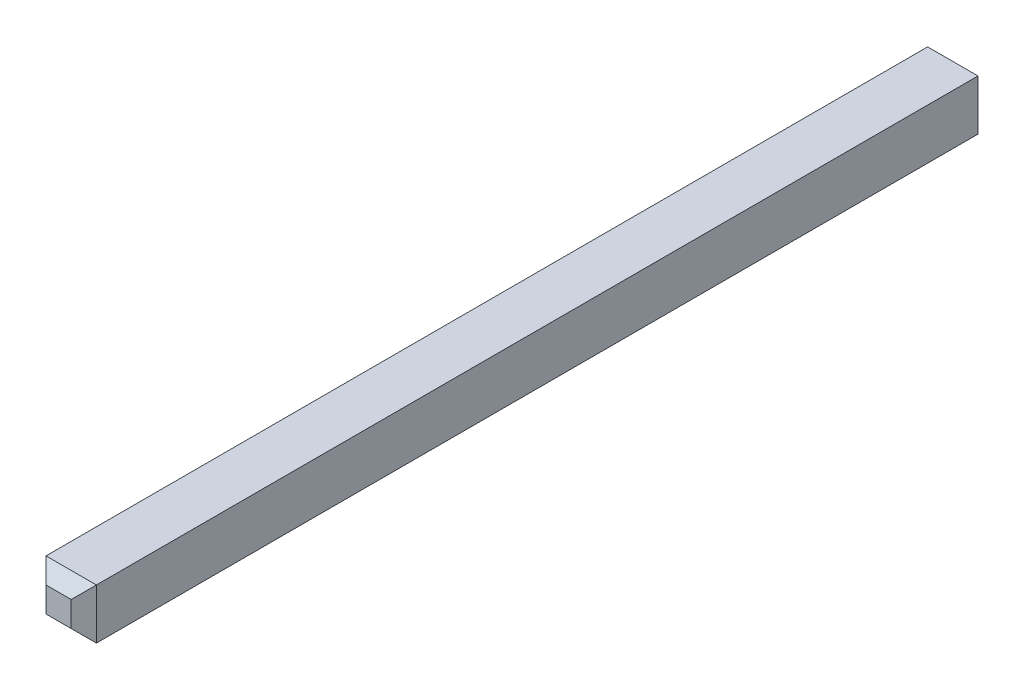
ISO-10303-21;
HEADER;
FILE_DESCRIPTION(('STEP AP214'),'2;1');
FILE_NAME('part.step','',(''),(''),'','','');
FILE_SCHEMA(('AUTOMOTIVE_DESIGN { 1 0 10303 214 1 1 1 1 }'));
ENDSEC;
DATA;
#1=APPLICATION_CONTEXT('core data for automotive mechanical design processes');
#2=APPLICATION_PROTOCOL_DEFINITION('international standard','automotive_design',2000,#1);
#3=PRODUCT_CONTEXT('',#1,'mechanical');
#4=PRODUCT('Part','Part','',(#3));
#5=PRODUCT_RELATED_PRODUCT_CATEGORY('part','',(#4));
#6=PRODUCT_DEFINITION_FORMATION('','',#4);
#7=PRODUCT_DEFINITION_CONTEXT('part definition',#1,'design');
#8=PRODUCT_DEFINITION('design','',#6,#7);
#9=PRODUCT_DEFINITION_SHAPE('','',#8);
#10=(LENGTH_UNIT() NAMED_UNIT(*) SI_UNIT(.MILLI.,.METRE.));
#11=(NAMED_UNIT(*) PLANE_ANGLE_UNIT() SI_UNIT($,.RADIAN.));
#12=(NAMED_UNIT(*) SI_UNIT($,.STERADIAN.) SOLID_ANGLE_UNIT());
#13=UNCERTAINTY_MEASURE_WITH_UNIT(LENGTH_MEASURE(1.E-05),#10,'distance_accuracy_value','');
#14=(GEOMETRIC_REPRESENTATION_CONTEXT(3) GLOBAL_UNCERTAINTY_ASSIGNED_CONTEXT((#13)) GLOBAL_UNIT_ASSIGNED_CONTEXT((#10,
#11,#12)) REPRESENTATION_CONTEXT('',''));
#15=CARTESIAN_POINT('',(0.,0.,0.));
#16=DIRECTION('',(0.,0.,1.));
#17=DIRECTION('',(1.,0.,0.));
#18=AXIS2_PLACEMENT_3D('',#15,#16,#17);
#19=CARTESIAN_POINT('',(-0.15875,-0.238125,-2.460625));
#20=DIRECTION('',(0.,-0.707106781186548,-0.707106781186548));
#21=DIRECTION('',(0.,0.707106781186548,-0.707106781186548));
#22=AXIS2_PLACEMENT_3D('',#19,#20,#21);
#23=PLANE('',#22);
#24=DIRECTION('',(1.,0.,0.));
#25=VECTOR('',#24,1.);
#26=CARTESIAN_POINT('',(-0.3175,-0.3175,-2.38125));
#27=LINE('',#26,#25);
#28=CARTESIAN_POINT('',(-0.3175,-0.3175,-2.38125));
#29=VERTEX_POINT('',#28);
#30=CARTESIAN_POINT('',(0.3175,-0.3175,-2.38125));
#31=VERTEX_POINT('',#30);
#32=EDGE_CURVE('E96',#29,#31,#27,.T.);
#33=ORIENTED_EDGE('',*,*,#32,.F.);
#34=DIRECTION('',(-0.577350269189626,-0.577350269189627,0.577350269189625));
#35=VECTOR('',#34,1.);
#36=CARTESIAN_POINT('',(-0.15875,-0.15875,-2.54));
#37=LINE('',#36,#35);
#38=CARTESIAN_POINT('',(-0.15875,-0.15875,-2.54));
#39=VERTEX_POINT('',#38);
#40=EDGE_CURVE('E94',#39,#29,#37,.T.);
#41=ORIENTED_EDGE('',*,*,#40,.F.);
#42=DIRECTION('',(-1.,0.,0.));
#43=VECTOR('',#42,1.);
#44=CARTESIAN_POINT('',(0.,-0.15875,-2.54));
#45=LINE('',#44,#43);
#46=CARTESIAN_POINT('',(0.15875,-0.15875,-2.54));
#47=VERTEX_POINT('',#46);
#48=EDGE_CURVE('E20',#47,#39,#45,.T.);
#49=ORIENTED_EDGE('',*,*,#48,.F.);
#50=DIRECTION('',(-0.577350269189626,0.577350269189627,-0.577350269189625));
#51=VECTOR('',#50,1.);
#52=CARTESIAN_POINT('',(0.3175,-0.3175,-2.38125));
#53=LINE('',#52,#51);
#54=EDGE_CURVE('E113',#31,#47,#53,.T.);
#55=ORIENTED_EDGE('',*,*,#54,.F.);
#56=EDGE_LOOP('',(#33,#41,#49,#55));
#57=FACE_BOUND('',#56,.T.);
#58=ADVANCED_FACE('F17',(#57),#23,.T.);
#59=CARTESIAN_POINT('',(-0.15875,-0.238125,8.810625));
#60=DIRECTION('',(0.,-0.707106781186547,0.707106781186548));
#61=DIRECTION('',(0.,-0.707106781186548,-0.707106781186547));
#62=AXIS2_PLACEMENT_3D('',#59,#60,#61);
#63=PLANE('',#62);
#64=DIRECTION('',(1.,0.,0.));
#65=VECTOR('',#64,1.);
#66=CARTESIAN_POINT('',(-0.3175,-0.3175,8.73125));
#67=LINE('',#66,#65);
#68=CARTESIAN_POINT('',(0.3175,-0.317500000000001,8.73125));
#69=VERTEX_POINT('',#68);
#70=CARTESIAN_POINT('',(-0.3175,-0.317500000000001,8.73125));
#71=VERTEX_POINT('',#70);
#72=EDGE_CURVE('E121',#69,#71,#67,.F.);
#73=ORIENTED_EDGE('',*,*,#72,.F.);
#74=DIRECTION('',(0.577350269189627,-0.577350269189624,-0.577350269189627));
#75=VECTOR('',#74,1.);
#76=CARTESIAN_POINT('',(0.15875,-0.15875,8.89));
#77=LINE('',#76,#75);
#78=CARTESIAN_POINT('',(0.15875,-0.15875,8.89));
#79=VERTEX_POINT('',#78);
#80=EDGE_CURVE('E118',#79,#69,#77,.T.);
#81=ORIENTED_EDGE('',*,*,#80,.F.);
#82=DIRECTION('',(1.,0.,0.));
#83=VECTOR('',#82,1.);
#84=CARTESIAN_POINT('',(0.,-0.15875,8.89));
#85=LINE('',#84,#83);
#86=CARTESIAN_POINT('',(-0.15875,-0.15875,8.89));
#87=VERTEX_POINT('',#86);
#88=EDGE_CURVE('E79',#87,#79,#85,.T.);
#89=ORIENTED_EDGE('',*,*,#88,.F.);
#90=DIRECTION('',(0.577350269189627,0.577350269189624,0.577350269189627));
#91=VECTOR('',#90,1.);
#92=CARTESIAN_POINT('',(-0.317500000000001,-0.3175,8.73125));
#93=LINE('',#92,#91);
#94=EDGE_CURVE('E106',#71,#87,#93,.T.);
#95=ORIENTED_EDGE('',*,*,#94,.F.);
#96=EDGE_LOOP('',(#73,#81,#89,#95));
#97=FACE_BOUND('',#96,.T.);
#98=ADVANCED_FACE('F283',(#97),#63,.T.);
#99=CARTESIAN_POINT('',(0.,0.,-2.54));
#100=DIRECTION('',(0.,0.,-1.));
#101=DIRECTION('',(-1.,0.,0.));
#102=AXIS2_PLACEMENT_3D('',#99,#100,#101);
#103=PLANE('',#102);
#104=DIRECTION('',(0.,1.,0.));
#105=VECTOR('',#104,1.);
#106=CARTESIAN_POINT('',(0.15875,-0.15875,-2.54));
#107=LINE('',#106,#105);
#108=CARTESIAN_POINT('',(0.15875,0.15875,-2.54));
#109=VERTEX_POINT('',#108);
#110=EDGE_CURVE('E90',#47,#109,#107,.T.);
#111=ORIENTED_EDGE('',*,*,#110,.F.);
#112=ORIENTED_EDGE('',*,*,#48,.T.);
#113=DIRECTION('',(0.,1.,0.));
#114=VECTOR('',#113,1.);
#115=CARTESIAN_POINT('',(-0.15875,0.15875,-2.54));
#116=LINE('',#115,#114);
#117=CARTESIAN_POINT('',(-0.15875,0.15875,-2.54));
#118=VERTEX_POINT('',#117);
#119=EDGE_CURVE('E88',#118,#39,#116,.F.);
#120=ORIENTED_EDGE('',*,*,#119,.F.);
#121=DIRECTION('',(1.,0.,0.));
#122=VECTOR('',#121,1.);
#123=CARTESIAN_POINT('',(0.15875,0.15875,-2.54));
#124=LINE('',#123,#122);
#125=EDGE_CURVE('E127',#109,#118,#124,.F.);
#126=ORIENTED_EDGE('',*,*,#125,.F.);
#127=EDGE_LOOP('',(#111,#112,#120,#126));
#128=FACE_BOUND('',#127,.T.);
#129=ADVANCED_FACE('F85',(#128),#103,.T.);
#130=CARTESIAN_POINT('',(-0.238125,0.15875,-2.460625));
#131=DIRECTION('',(-0.707106781186548,0.,-0.707106781186548));
#132=DIRECTION('',(-0.707106781186548,0.,0.707106781186548));
#133=AXIS2_PLACEMENT_3D('',#130,#131,#132);
#134=PLANE('',#133);
#135=DIRECTION('',(0.,1.,0.));
#136=VECTOR('',#135,1.);
#137=CARTESIAN_POINT('',(-0.3175,0.3175,-2.38125));
#138=LINE('',#137,#136);
#139=CARTESIAN_POINT('',(-0.3175,0.3175,-2.38125));
#140=VERTEX_POINT('',#139);
#141=EDGE_CURVE('E130',#140,#29,#138,.F.);
#142=ORIENTED_EDGE('',*,*,#141,.F.);
#143=DIRECTION('',(-0.577350269189627,0.577350269189626,0.577350269189625));
#144=VECTOR('',#143,1.);
#145=CARTESIAN_POINT('',(-0.15875,0.15875,-2.54));
#146=LINE('',#145,#144);
#147=EDGE_CURVE('E102',#118,#140,#146,.T.);
#148=ORIENTED_EDGE('',*,*,#147,.F.);
#149=ORIENTED_EDGE('',*,*,#119,.T.);
#150=ORIENTED_EDGE('',*,*,#40,.T.);
#151=EDGE_LOOP('',(#142,#148,#149,#150));
#152=FACE_BOUND('',#151,.T.);
#153=ADVANCED_FACE('F100',(#152),#134,.T.);
#154=CARTESIAN_POINT('',(0.,0.,8.89));
#155=DIRECTION('',(0.,0.,1.));
#156=DIRECTION('',(1.,0.,0.));
#157=AXIS2_PLACEMENT_3D('',#154,#155,#156);
#158=PLANE('',#157);
#159=ORIENTED_EDGE('',*,*,#88,.T.);
#160=DIRECTION('',(0.,1.,0.));
#161=VECTOR('',#160,1.);
#162=CARTESIAN_POINT('',(0.15875,-0.15875,8.89));
#163=LINE('',#162,#161);
#164=CARTESIAN_POINT('',(0.15875,0.15875,8.89));
#165=VERTEX_POINT('',#164);
#166=EDGE_CURVE('E115',#165,#79,#163,.F.);
#167=ORIENTED_EDGE('',*,*,#166,.F.);
#168=DIRECTION('',(1.,0.,0.));
#169=VECTOR('',#168,1.);
#170=CARTESIAN_POINT('',(0.15875,0.15875,8.89));
#171=LINE('',#170,#169);
#172=CARTESIAN_POINT('',(-0.15875,0.15875,8.89));
#173=VERTEX_POINT('',#172);
#174=EDGE_CURVE('E139',#173,#165,#171,.T.);
#175=ORIENTED_EDGE('',*,*,#174,.F.);
#176=DIRECTION('',(0.,1.,0.));
#177=VECTOR('',#176,1.);
#178=CARTESIAN_POINT('',(-0.15875,0.15875,8.89));
#179=LINE('',#178,#177);
#180=EDGE_CURVE('E109',#87,#173,#179,.T.);
#181=ORIENTED_EDGE('',*,*,#180,.F.);
#182=EDGE_LOOP('',(#159,#167,#175,#181));
#183=FACE_BOUND('',#182,.T.);
#184=ADVANCED_FACE('F259',(#183),#158,.T.);
#185=CARTESIAN_POINT('',(-0.238125,0.15875,8.810625));
#186=DIRECTION('',(-0.707106781186547,0.,0.707106781186548));
#187=DIRECTION('',(0.707106781186548,0.,0.707106781186547));
#188=AXIS2_PLACEMENT_3D('',#185,#186,#187);
#189=PLANE('',#188);
#190=ORIENTED_EDGE('',*,*,#180,.T.);
#191=DIRECTION('',(0.577350269189624,-0.577350269189627,0.577350269189627));
#192=VECTOR('',#191,1.);
#193=CARTESIAN_POINT('',(-0.3175,0.317500000000001,8.73125));
#194=LINE('',#193,#192);
#195=CARTESIAN_POINT('',(-0.317500000000001,0.3175,8.73125));
#196=VERTEX_POINT('',#195);
#197=EDGE_CURVE('E144',#196,#173,#194,.T.);
#198=ORIENTED_EDGE('',*,*,#197,.F.);
#199=DIRECTION('',(0.,1.,0.));
#200=VECTOR('',#199,1.);
#201=CARTESIAN_POINT('',(-0.3175,0.3175,8.73125));
#202=LINE('',#201,#200);
#203=EDGE_CURVE('E136',#71,#196,#202,.T.);
#204=ORIENTED_EDGE('',*,*,#203,.F.);
#205=ORIENTED_EDGE('',*,*,#94,.T.);
#206=EDGE_LOOP('',(#190,#198,#204,#205));
#207=FACE_BOUND('',#206,.T.);
#208=ADVANCED_FACE('F251',(#207),#189,.T.);
#209=CARTESIAN_POINT('',(0.238125,-0.15875,-2.460625));
#210=DIRECTION('',(0.707106781186548,0.,-0.707106781186548));
#211=DIRECTION('',(-0.707106781186548,0.,-0.707106781186548));
#212=AXIS2_PLACEMENT_3D('',#209,#210,#211);
#213=PLANE('',#212);
#214=DIRECTION('',(0.,1.,0.));
#215=VECTOR('',#214,1.);
#216=CARTESIAN_POINT('',(0.3175,-0.3175,-2.38125));
#217=LINE('',#216,#215);
#218=CARTESIAN_POINT('',(0.3175,0.3175,-2.38125));
#219=VERTEX_POINT('',#218);
#220=EDGE_CURVE('E147',#31,#219,#217,.T.);
#221=ORIENTED_EDGE('',*,*,#220,.F.);
#222=ORIENTED_EDGE('',*,*,#54,.T.);
#223=ORIENTED_EDGE('',*,*,#110,.T.);
#224=DIRECTION('',(-0.577350269189627,-0.577350269189626,-0.577350269189625));
#225=VECTOR('',#224,1.);
#226=CARTESIAN_POINT('',(0.3175,0.3175,-2.38125));
#227=LINE('',#226,#225);
#228=EDGE_CURVE('E124',#219,#109,#227,.T.);
#229=ORIENTED_EDGE('',*,*,#228,.F.);
#230=EDGE_LOOP('',(#221,#222,#223,#229));
#231=FACE_BOUND('',#230,.T.);
#232=ADVANCED_FACE('F173',(#231),#213,.T.);
#233=CARTESIAN_POINT('',(0.238125,-0.15875,8.810625));
#234=DIRECTION('',(0.707106781186547,0.,0.707106781186548));
#235=DIRECTION('',(0.707106781186548,0.,-0.707106781186547));
#236=AXIS2_PLACEMENT_3D('',#233,#234,#235);
#237=PLANE('',#236);
#238=DIRECTION('',(0.,1.,0.));
#239=VECTOR('',#238,1.);
#240=CARTESIAN_POINT('',(0.3175,-0.3175,8.73125));
#241=LINE('',#240,#239);
#242=CARTESIAN_POINT('',(0.317500000000001,0.3175,8.73125));
#243=VERTEX_POINT('',#242);
#244=EDGE_CURVE('E35',#243,#69,#241,.F.);
#245=ORIENTED_EDGE('',*,*,#244,.F.);
#246=DIRECTION('',(0.577350269189624,0.577350269189627,-0.577350269189627));
#247=VECTOR('',#246,1.);
#248=CARTESIAN_POINT('',(0.15875,0.15875,8.89));
#249=LINE('',#248,#247);
#250=EDGE_CURVE('E142',#165,#243,#249,.T.);
#251=ORIENTED_EDGE('',*,*,#250,.F.);
#252=ORIENTED_EDGE('',*,*,#166,.T.);
#253=ORIENTED_EDGE('',*,*,#80,.T.);
#254=EDGE_LOOP('',(#245,#251,#252,#253));
#255=FACE_BOUND('',#254,.T.);
#256=ADVANCED_FACE('F190',(#255),#237,.T.);
#257=CARTESIAN_POINT('',(-0.3175,-0.3175,0.));
#258=DIRECTION('',(0.,-1.,0.));
#259=DIRECTION('',(0.,0.,-1.));
#260=AXIS2_PLACEMENT_3D('',#257,#258,#259);
#261=PLANE('',#260);
#262=ORIENTED_EDGE('',*,*,#72,.T.);
#263=DIRECTION('',(0.,0.,1.));
#264=VECTOR('',#263,1.);
#265=CARTESIAN_POINT('',(-0.3175,-0.3175,0.));
#266=LINE('',#265,#264);
#267=EDGE_CURVE('E133',#29,#71,#266,.T.);
#268=ORIENTED_EDGE('',*,*,#267,.F.);
#269=ORIENTED_EDGE('',*,*,#32,.T.);
#270=DIRECTION('',(0.,0.,-1.));
#271=VECTOR('',#270,1.);
#272=CARTESIAN_POINT('',(0.3175,-0.3175,0.));
#273=LINE('',#272,#271);
#274=EDGE_CURVE('E151',#69,#31,#273,.T.);
#275=ORIENTED_EDGE('',*,*,#274,.F.);
#276=EDGE_LOOP('',(#262,#268,#269,#275));
#277=FACE_BOUND('',#276,.T.);
#278=ADVANCED_FACE('F176',(#277),#261,.T.);
#279=CARTESIAN_POINT('',(0.15875,0.238125,-2.460625));
#280=DIRECTION('',(0.,0.707106781186548,-0.707106781186548));
#281=DIRECTION('',(0.,0.707106781186548,0.707106781186548));
#282=AXIS2_PLACEMENT_3D('',#279,#280,#281);
#283=PLANE('',#282);
#284=ORIENTED_EDGE('',*,*,#125,.T.);
#285=ORIENTED_EDGE('',*,*,#147,.T.);
#286=DIRECTION('',(1.,0.,0.));
#287=VECTOR('',#286,1.);
#288=CARTESIAN_POINT('',(0.3175,0.3175,-2.38125));
#289=LINE('',#288,#287);
#290=EDGE_CURVE('E154',#219,#140,#289,.F.);
#291=ORIENTED_EDGE('',*,*,#290,.F.);
#292=ORIENTED_EDGE('',*,*,#228,.T.);
#293=EDGE_LOOP('',(#284,#285,#291,#292));
#294=FACE_BOUND('',#293,.T.);
#295=ADVANCED_FACE('F181',(#294),#283,.T.);
#296=CARTESIAN_POINT('',(-0.3175,0.3175,0.));
#297=DIRECTION('',(-1.,0.,0.));
#298=DIRECTION('',(0.,0.,1.));
#299=AXIS2_PLACEMENT_3D('',#296,#297,#298);
#300=PLANE('',#299);
#301=ORIENTED_EDGE('',*,*,#203,.T.);
#302=DIRECTION('',(0.,0.,1.));
#303=VECTOR('',#302,1.);
#304=CARTESIAN_POINT('',(-0.3175,0.3175,0.));
#305=LINE('',#304,#303);
#306=EDGE_CURVE('E157',#140,#196,#305,.T.);
#307=ORIENTED_EDGE('',*,*,#306,.F.);
#308=ORIENTED_EDGE('',*,*,#141,.T.);
#309=ORIENTED_EDGE('',*,*,#267,.T.);
#310=EDGE_LOOP('',(#301,#307,#308,#309));
#311=FACE_BOUND('',#310,.T.);
#312=ADVANCED_FACE('F179',(#311),#300,.T.);
#313=CARTESIAN_POINT('',(0.15875,0.238125,8.810625));
#314=DIRECTION('',(0.,0.707106781186547,0.707106781186548));
#315=DIRECTION('',(0.,-0.707106781186548,0.707106781186547));
#316=AXIS2_PLACEMENT_3D('',#313,#314,#315);
#317=PLANE('',#316);
#318=DIRECTION('',(1.,0.,0.));
#319=VECTOR('',#318,1.);
#320=CARTESIAN_POINT('',(0.3175,0.3175,8.73125));
#321=LINE('',#320,#319);
#322=EDGE_CURVE('E26',#196,#243,#321,.T.);
#323=ORIENTED_EDGE('',*,*,#322,.F.);
#324=ORIENTED_EDGE('',*,*,#197,.T.);
#325=ORIENTED_EDGE('',*,*,#174,.T.);
#326=ORIENTED_EDGE('',*,*,#250,.T.);
#327=EDGE_LOOP('',(#323,#324,#325,#326));
#328=FACE_BOUND('',#327,.T.);
#329=ADVANCED_FACE('F167',(#328),#317,.T.);
#330=CARTESIAN_POINT('',(0.3175,-0.3175,0.));
#331=DIRECTION('',(1.,0.,0.));
#332=DIRECTION('',(0.,0.,-1.));
#333=AXIS2_PLACEMENT_3D('',#330,#331,#332);
#334=PLANE('',#333);
#335=ORIENTED_EDGE('',*,*,#244,.T.);
#336=ORIENTED_EDGE('',*,*,#274,.T.);
#337=ORIENTED_EDGE('',*,*,#220,.T.);
#338=DIRECTION('',(0.,0.,1.));
#339=VECTOR('',#338,1.);
#340=CARTESIAN_POINT('',(0.3175,0.3175,0.));
#341=LINE('',#340,#339);
#342=EDGE_CURVE('E11',#243,#219,#341,.F.);
#343=ORIENTED_EDGE('',*,*,#342,.F.);
#344=EDGE_LOOP('',(#335,#336,#337,#343));
#345=FACE_BOUND('',#344,.T.);
#346=ADVANCED_FACE('F169',(#345),#334,.T.);
#347=CARTESIAN_POINT('',(0.3175,0.3175,0.));
#348=DIRECTION('',(0.,1.,0.));
#349=DIRECTION('',(0.,0.,1.));
#350=AXIS2_PLACEMENT_3D('',#347,#348,#349);
#351=PLANE('',#350);
#352=ORIENTED_EDGE('',*,*,#322,.T.);
#353=ORIENTED_EDGE('',*,*,#342,.T.);
#354=ORIENTED_EDGE('',*,*,#290,.T.);
#355=ORIENTED_EDGE('',*,*,#306,.T.);
#356=EDGE_LOOP('',(#352,#353,#354,#355));
#357=FACE_BOUND('',#356,.T.);
#358=ADVANCED_FACE('F163',(#357),#351,.T.);
#359=CLOSED_SHELL('',(#58,#98,#129,#153,#184,#208,#232,#256,#278,#295,#312,#329,#346,#358));
#360=MANIFOLD_SOLID_BREP('B1',#359);
#361=ADVANCED_BREP_SHAPE_REPRESENTATION('',(#18,#360),#14);
#362=SHAPE_DEFINITION_REPRESENTATION(#9,#361);
ENDSEC;
END-ISO-10303-21;
